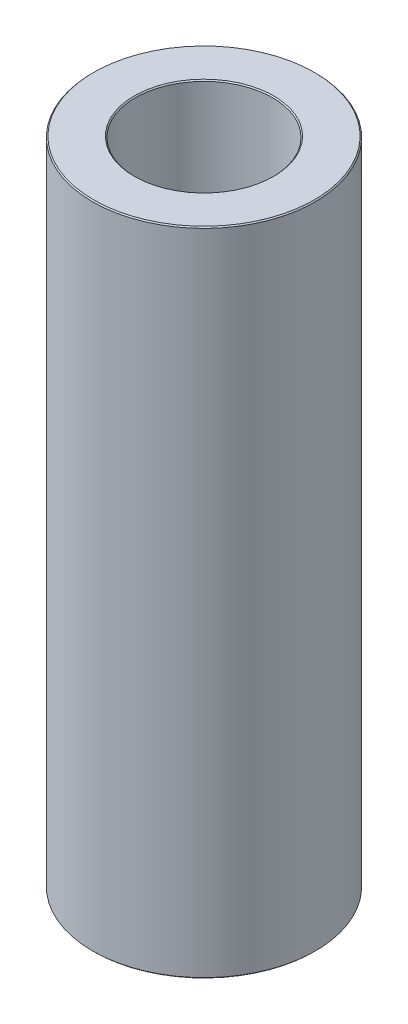
ISO-10303-21;
HEADER;
FILE_DESCRIPTION(('STEP AP214'),'2;1');
FILE_NAME('part.step','',(''),(''),'','','');
FILE_SCHEMA(('AUTOMOTIVE_DESIGN { 1 0 10303 214 1 1 1 1 }'));
ENDSEC;
DATA;
#1=APPLICATION_CONTEXT('core data for automotive mechanical design processes');
#2=APPLICATION_PROTOCOL_DEFINITION('international standard','automotive_design',2000,#1);
#3=PRODUCT_CONTEXT('',#1,'mechanical');
#4=PRODUCT('Part','Part','',(#3));
#5=PRODUCT_RELATED_PRODUCT_CATEGORY('part','',(#4));
#6=PRODUCT_DEFINITION_FORMATION('','',#4);
#7=PRODUCT_DEFINITION_CONTEXT('part definition',#1,'design');
#8=PRODUCT_DEFINITION('design','',#6,#7);
#9=PRODUCT_DEFINITION_SHAPE('','',#8);
#10=(LENGTH_UNIT() NAMED_UNIT(*) SI_UNIT(.MILLI.,.METRE.));
#11=(NAMED_UNIT(*) PLANE_ANGLE_UNIT() SI_UNIT($,.RADIAN.));
#12=(NAMED_UNIT(*) SI_UNIT($,.STERADIAN.) SOLID_ANGLE_UNIT());
#13=UNCERTAINTY_MEASURE_WITH_UNIT(LENGTH_MEASURE(1.E-05),#10,'distance_accuracy_value','');
#14=(GEOMETRIC_REPRESENTATION_CONTEXT(3) GLOBAL_UNCERTAINTY_ASSIGNED_CONTEXT((#13)) GLOBAL_UNIT_ASSIGNED_CONTEXT((#10,
#11,#12)) REPRESENTATION_CONTEXT('',''));
#15=CARTESIAN_POINT('',(0.,0.,0.));
#16=DIRECTION('',(0.,0.,1.));
#17=DIRECTION('',(1.,0.,0.));
#18=AXIS2_PLACEMENT_3D('',#15,#16,#17);
#19=CARTESIAN_POINT('',(0.,189.784245098665,0.));
#20=DIRECTION('',(0.,-1.,0.));
#21=DIRECTION('',(0.,0.,-1.));
#22=AXIS2_PLACEMENT_3D('',#19,#20,#21);
#23=CYLINDRICAL_SURFACE('',#22,32.5);
#24=CARTESIAN_POINT('',(0.,0.319615731060319,0.));
#25=DIRECTION('',(0.,1.,0.));
#26=DIRECTION('',(0.,0.,1.));
#27=AXIS2_PLACEMENT_3D('',#24,#25,#26);
#28=CIRCLE('',#27,32.5);
#29=CARTESIAN_POINT('',(0.,0.319615731060319,32.5));
#30=VERTEX_POINT('',#29);
#31=EDGE_CURVE('E10',#30,#30,#28,.T.);
#32=ORIENTED_EDGE('',*,*,#31,.T.);
#33=EDGE_LOOP('',(#32));
#34=FACE_BOUND('',#33,.T.);
#35=CARTESIAN_POINT('',(0.,189.464629367605,0.));
#36=DIRECTION('',(0.,1.,0.));
#37=DIRECTION('',(0.,0.,1.));
#38=AXIS2_PLACEMENT_3D('',#35,#36,#37);
#39=CIRCLE('',#38,32.5);
#40=CARTESIAN_POINT('',(0.,189.464629367605,-32.5));
#41=VERTEX_POINT('',#40);
#42=EDGE_CURVE('E50',#41,#41,#39,.F.);
#43=ORIENTED_EDGE('',*,*,#42,.T.);
#44=EDGE_LOOP('',(#43));
#45=FACE_BOUND('',#44,.T.);
#46=ADVANCED_FACE('F39',(#34,#45),#23,.T.);
#47=CARTESIAN_POINT('',(0.,189.784245098665,0.));
#48=DIRECTION('',(0.,1.,0.));
#49=DIRECTION('',(0.,0.,1.));
#50=AXIS2_PLACEMENT_3D('',#47,#48,#49);
#51=PLANE('',#50);
#52=CARTESIAN_POINT('',(0.,189.784245098665,0.));
#53=DIRECTION('',(0.,1.,0.));
#54=DIRECTION('',(0.,0.,1.));
#55=AXIS2_PLACEMENT_3D('',#52,#53,#54);
#56=CIRCLE('',#55,20.3287487425067);
#57=CARTESIAN_POINT('',(0.,189.784245098665,20.3287487425067));
#58=VERTEX_POINT('',#57);
#59=EDGE_CURVE('E58',#58,#58,#56,.F.);
#60=ORIENTED_EDGE('',*,*,#59,.T.);
#61=EDGE_LOOP('',(#60));
#62=FACE_BOUND('',#61,.T.);
#63=CARTESIAN_POINT('',(0.,189.784245098665,0.));
#64=DIRECTION('',(0.,1.,0.));
#65=DIRECTION('',(0.,0.,1.));
#66=AXIS2_PLACEMENT_3D('',#63,#64,#65);
#67=CIRCLE('',#66,32.1803842689397);
#68=CARTESIAN_POINT('',(0.,189.784245098665,-32.1803842689397));
#69=VERTEX_POINT('',#68);
#70=EDGE_CURVE('E61',#69,#69,#67,.T.);
#71=ORIENTED_EDGE('',*,*,#70,.T.);
#72=EDGE_LOOP('',(#71));
#73=FACE_BOUND('',#72,.T.);
#74=ADVANCED_FACE('F88',(#62,#73),#51,.T.);
#75=CARTESIAN_POINT('',(0.,0.,0.));
#76=DIRECTION('',(0.,1.,0.));
#77=DIRECTION('',(0.,0.,1.));
#78=AXIS2_PLACEMENT_3D('',#75,#76,#77);
#79=PLANE('',#78);
#80=CARTESIAN_POINT('',(0.,0.,0.));
#81=DIRECTION('',(0.,1.,0.));
#82=DIRECTION('',(0.,0.,1.));
#83=AXIS2_PLACEMENT_3D('',#80,#81,#82);
#84=CIRCLE('',#83,20.3287487425067);
#85=CARTESIAN_POINT('',(0.,0.,20.3287487425067));
#86=VERTEX_POINT('',#85);
#87=EDGE_CURVE('E51',#86,#86,#84,.T.);
#88=ORIENTED_EDGE('',*,*,#87,.T.);
#89=EDGE_LOOP('',(#88));
#90=FACE_BOUND('',#89,.T.);
#91=CARTESIAN_POINT('',(0.,0.,0.));
#92=DIRECTION('',(0.,1.,0.));
#93=DIRECTION('',(0.,0.,1.));
#94=AXIS2_PLACEMENT_3D('',#91,#92,#93);
#95=CIRCLE('',#94,32.1803842689397);
#96=CARTESIAN_POINT('',(0.,0.,32.1803842689397));
#97=VERTEX_POINT('',#96);
#98=EDGE_CURVE('E54',#97,#97,#95,.F.);
#99=ORIENTED_EDGE('',*,*,#98,.T.);
#100=EDGE_LOOP('',(#99));
#101=FACE_BOUND('',#100,.T.);
#102=ADVANCED_FACE('F83',(#90,#101),#79,.F.);
#103=CARTESIAN_POINT('',(0.,189.784245098665,0.));
#104=DIRECTION('',(0.,-1.,0.));
#105=DIRECTION('',(0.,0.,-1.));
#106=AXIS2_PLACEMENT_3D('',#103,#104,#105);
#107=CYLINDRICAL_SURFACE('',#106,20.0091330114464);
#108=CARTESIAN_POINT('',(0.,189.464629367605,0.));
#109=DIRECTION('',(0.,1.,0.));
#110=DIRECTION('',(0.,0.,1.));
#111=AXIS2_PLACEMENT_3D('',#108,#109,#110);
#112=CIRCLE('',#111,20.0091330114464);
#113=CARTESIAN_POINT('',(0.,189.464629367605,20.0091330114464));
#114=VERTEX_POINT('',#113);
#115=EDGE_CURVE('E67',#114,#114,#112,.T.);
#116=ORIENTED_EDGE('',*,*,#115,.T.);
#117=EDGE_LOOP('',(#116));
#118=FACE_BOUND('',#117,.T.);
#119=CARTESIAN_POINT('',(0.,0.319615731060319,0.));
#120=DIRECTION('',(0.,1.,0.));
#121=DIRECTION('',(0.,0.,1.));
#122=AXIS2_PLACEMENT_3D('',#119,#120,#121);
#123=CIRCLE('',#122,20.0091330114464);
#124=CARTESIAN_POINT('',(0.,0.319615731060319,20.0091330114464));
#125=VERTEX_POINT('',#124);
#126=EDGE_CURVE('E69',#125,#125,#123,.F.);
#127=ORIENTED_EDGE('',*,*,#126,.T.);
#128=EDGE_LOOP('',(#127));
#129=FACE_BOUND('',#128,.T.);
#130=ADVANCED_FACE('F71',(#118,#129),#107,.F.);
#131=CARTESIAN_POINT('',(0.,189.464629367605,0.));
#132=DIRECTION('',(0.,1.,0.));
#133=DIRECTION('',(0.,0.,1.));
#134=AXIS2_PLACEMENT_3D('',#131,#132,#133);
#135=CONICAL_SURFACE('',#134,20.0091330114464,0.785398163397443);
#136=ORIENTED_EDGE('',*,*,#59,.F.);
#137=EDGE_LOOP('',(#136));
#138=FACE_BOUND('',#137,.T.);
#139=ORIENTED_EDGE('',*,*,#115,.F.);
#140=EDGE_LOOP('',(#139));
#141=FACE_BOUND('',#140,.T.);
#142=ADVANCED_FACE('F77',(#138,#141),#135,.F.);
#143=CARTESIAN_POINT('',(0.,0.,0.));
#144=DIRECTION('',(0.,-1.,0.));
#145=DIRECTION('',(0.,0.,-1.));
#146=AXIS2_PLACEMENT_3D('',#143,#144,#145);
#147=CONICAL_SURFACE('',#146,20.3287487425067,0.785398163397443);
#148=ORIENTED_EDGE('',*,*,#126,.F.);
#149=EDGE_LOOP('',(#148));
#150=FACE_BOUND('',#149,.T.);
#151=ORIENTED_EDGE('',*,*,#87,.F.);
#152=EDGE_LOOP('',(#151));
#153=FACE_BOUND('',#152,.T.);
#154=ADVANCED_FACE('F73',(#150,#153),#147,.F.);
#155=CARTESIAN_POINT('',(0.,0.319615731060319,0.));
#156=DIRECTION('',(0.,1.,0.));
#157=DIRECTION('',(0.,0.,1.));
#158=AXIS2_PLACEMENT_3D('',#155,#156,#157);
#159=CONICAL_SURFACE('',#158,32.5,0.785398163397492);
#160=ORIENTED_EDGE('',*,*,#98,.F.);
#161=EDGE_LOOP('',(#160));
#162=FACE_BOUND('',#161,.T.);
#163=ORIENTED_EDGE('',*,*,#31,.F.);
#164=EDGE_LOOP('',(#163));
#165=FACE_BOUND('',#164,.T.);
#166=ADVANCED_FACE('F76',(#162,#165),#159,.T.);
#167=CARTESIAN_POINT('',(0.,189.784245098665,0.));
#168=DIRECTION('',(0.,-1.,0.));
#169=DIRECTION('',(0.,0.,-1.));
#170=AXIS2_PLACEMENT_3D('',#167,#168,#169);
#171=CONICAL_SURFACE('',#170,32.1803842689397,0.785398163397448);
#172=CARTESIAN_POINT('',(0.,189.464629367605,-32.5));
#173=CARTESIAN_POINT('',(0.,189.467958698137,-32.4966706694681));
#174=CARTESIAN_POINT('',(0.,189.471288028669,-32.4933413389363));
#175=CARTESIAN_POINT('',(0.,189.477946689732,-32.4866826778725));
#176=CARTESIAN_POINT('',(0.,189.481276020264,-32.4833533473406));
#177=CARTESIAN_POINT('',(0.,189.487934681328,-32.4766946862769));
#178=CARTESIAN_POINT('',(0.,189.49126401186,-32.473365355745));
#179=CARTESIAN_POINT('',(0.,189.497922672924,-32.4667066946812));
#180=CARTESIAN_POINT('',(0.,189.501252003456,-32.4633773641494));
#181=CARTESIAN_POINT('',(0.,189.507910664519,-32.4567187030856));
#182=CARTESIAN_POINT('',(0.,189.511239995051,-32.4533893725537));
#183=CARTESIAN_POINT('',(0.,189.517898656115,-32.4467307114899));
#184=CARTESIAN_POINT('',(0.,189.521227986647,-32.4434013809581));
#185=CARTESIAN_POINT('',(0.,189.527886647711,-32.4367427198943));
#186=CARTESIAN_POINT('',(0.,189.531215978242,-32.4334133893624));
#187=CARTESIAN_POINT('',(0.,189.537874639306,-32.4267547282987));
#188=CARTESIAN_POINT('',(0.,189.541203969838,-32.4234253977668));
#189=CARTESIAN_POINT('',(0.,189.547862630902,-32.4167667367031));
#190=CARTESIAN_POINT('',(0.,189.551191961434,-32.4134374061712));
#191=CARTESIAN_POINT('',(0.,189.557850622497,-32.4067787451074));
#192=CARTESIAN_POINT('',(0.,189.561179953029,-32.4034494145755));
#193=CARTESIAN_POINT('',(0.,189.567838614093,-32.3967907535118));
#194=CARTESIAN_POINT('',(0.,189.571167944625,-32.3934614229799));
#195=CARTESIAN_POINT('',(0.,189.577826605689,-32.3868027619162));
#196=CARTESIAN_POINT('',(0.,189.581155936221,-32.3834734313843));
#197=CARTESIAN_POINT('',(0.,189.587814597284,-32.3768147703205));
#198=CARTESIAN_POINT('',(0.,189.591143927816,-32.3734854397886));
#199=CARTESIAN_POINT('',(0.,189.59780258888,-32.3668267787249));
#200=CARTESIAN_POINT('',(0.,189.601131919412,-32.363497448193));
#201=CARTESIAN_POINT('',(0.,189.607790580476,-32.3568387871292));
#202=CARTESIAN_POINT('',(0.,189.611119911007,-32.3535094565974));
#203=CARTESIAN_POINT('',(0.,189.617778572071,-32.3468507955336));
#204=CARTESIAN_POINT('',(0.,189.621107902603,-32.3435214650017));
#205=CARTESIAN_POINT('',(0.,189.627766563667,-32.336862803938));
#206=CARTESIAN_POINT('',(0.,189.631095894199,-32.3335334734061));
#207=CARTESIAN_POINT('',(0.,189.637754555262,-32.3268748123423));
#208=CARTESIAN_POINT('',(0.,189.641083885794,-32.3235454818105));
#209=CARTESIAN_POINT('',(0.,189.647742546858,-32.3168868207467));
#210=CARTESIAN_POINT('',(0.,189.65107187739,-32.3135574902148));
#211=CARTESIAN_POINT('',(0.,189.657730538454,-32.3068988291511));
#212=CARTESIAN_POINT('',(0.,189.661059868986,-32.3035694986192));
#213=CARTESIAN_POINT('',(0.,189.667718530049,-32.2969108375554));
#214=CARTESIAN_POINT('',(0.,189.671047860581,-32.2935815070235));
#215=CARTESIAN_POINT('',(0.,189.677706521645,-32.2869228459598));
#216=CARTESIAN_POINT('',(0.,189.681035852177,-32.2835935154279));
#217=CARTESIAN_POINT('',(0.,189.687694513241,-32.2769348543641));
#218=CARTESIAN_POINT('',(0.,189.691023843773,-32.2736055238323));
#219=CARTESIAN_POINT('',(0.,189.697682504836,-32.2669468627685));
#220=CARTESIAN_POINT('',(0.,189.701011835368,-32.2636175322366));
#221=CARTESIAN_POINT('',(0.,189.707670496432,-32.2569588711729));
#222=CARTESIAN_POINT('',(0.,189.710999826964,-32.253629540641));
#223=CARTESIAN_POINT('',(0.,189.717658488028,-32.2469708795772));
#224=CARTESIAN_POINT('',(0.,189.720987818559,-32.2436415490454));
#225=CARTESIAN_POINT('',(0.,189.727646479623,-32.2369828879816));
#226=CARTESIAN_POINT('',(0.,189.730975810155,-32.2336535574497));
#227=CARTESIAN_POINT('',(0.,189.737634471219,-32.226994896386));
#228=CARTESIAN_POINT('',(0.,189.740963801751,-32.2236655658541));
#229=CARTESIAN_POINT('',(0.,189.747622462814,-32.2170069047903));
#230=CARTESIAN_POINT('',(0.,189.750951793346,-32.2136775742585));
#231=CARTESIAN_POINT('',(0.,189.75761045441,-32.2070189131947));
#232=CARTESIAN_POINT('',(0.,189.760939784942,-32.2036895826628));
#233=CARTESIAN_POINT('',(0.,189.767598446006,-32.1970309215991));
#234=CARTESIAN_POINT('',(0.,189.770927776538,-32.1937015910672));
#235=CARTESIAN_POINT('',(0.,189.777586437601,-32.1870429300034));
#236=CARTESIAN_POINT('',(0.,189.780915768133,-32.1837135994715));
#237=CARTESIAN_POINT('',(0.,189.784245098665,-32.1803842689397));
#238=B_SPLINE_CURVE_WITH_KNOTS('',3,(#172,#173,#174,#175,#176,#177,#178,#179,#180,#181,#182,
#183,#184,#185,#186,#187,#188,#189,#190,#191,#192,#193,#194,#195,#196,#197,#198,#199,#200,#201,
#202,#203,#204,#205,#206,#207,#208,#209,#210,#211,#212,#213,#214,#215,#216,#217,#218,#219,#220,
#221,#222,#223,#224,#225,#226,#227,#228,#229,#230,#231,#232,#233,#234,#235,#236,#237),
.UNSPECIFIED.,.F.,.F.,(4,2,2,2,2,2,2,2,2,2,2,2,2,2,2,2,2,2,2,2,2,2,2,2,2,2,2,2,2,2,2,2,4),(0.,
0.0141251531754302,0.0282503063508407,0.0423754595262513,0.0565006127016814,0.0706257658770969,
0.0847509190525074,0.0988760722279179,0.113001225403348,0.127126378578759,0.141251531754169,
0.155376684929599,0.16950183810501,0.183626991280425,0.197752144455836,0.211877297631266,
0.226002450806677,0.240127603982087,0.254252757157517,0.268377910332928,0.282503063508338,
0.296628216683754,0.310753369859184,0.324878523034595,0.339003676210005,0.353128829385435,
0.367253982560846,0.381379135736256,0.395504288911672,0.409629442087102,0.423754595262512,
0.437879748437923,0.452004901613353),.UNSPECIFIED.);
#239=EDGE_CURVE('BSEAM45',#41,#69,#238,.T.);
#240=ORIENTED_EDGE('',*,*,#42,.F.);
#241=ORIENTED_EDGE('',*,*,#70,.F.);
#242=ORIENTED_EDGE('',*,*,#239,.T.);
#243=ORIENTED_EDGE('',*,*,#239,.F.);
#244=EDGE_LOOP('',(#240,#242,#241,#243));
#245=FACE_BOUND('',#244,.T.);
#246=ADVANCED_FACE('F45',(#245),#171,.T.);
#247=CLOSED_SHELL('',(#46,#74,#102,#130,#142,#154,#166,#246));
#248=MANIFOLD_SOLID_BREP('B2',#247);
#249=ADVANCED_BREP_SHAPE_REPRESENTATION('',(#18,#248),#14);
#250=SHAPE_DEFINITION_REPRESENTATION(#9,#249);
ENDSEC;
END-ISO-10303-21;
